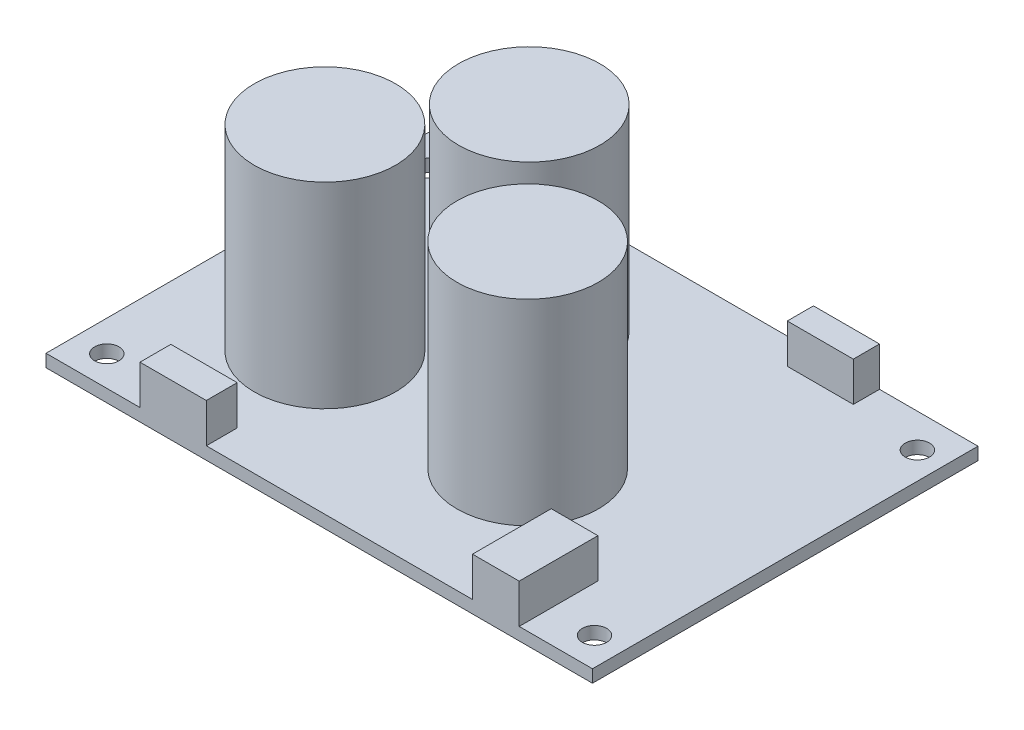
ISO-10303-21;
HEADER;
FILE_DESCRIPTION(('STEP AP214'),'2;1');
FILE_NAME('part.step','',(''),(''),'','','');
FILE_SCHEMA(('AUTOMOTIVE_DESIGN { 1 0 10303 214 1 1 1 1 }'));
ENDSEC;
DATA;
#1=APPLICATION_CONTEXT('core data for automotive mechanical design processes');
#2=APPLICATION_PROTOCOL_DEFINITION('international standard','automotive_design',2000,#1);
#3=PRODUCT_CONTEXT('',#1,'mechanical');
#4=PRODUCT('Part','Part','',(#3));
#5=PRODUCT_RELATED_PRODUCT_CATEGORY('part','',(#4));
#6=PRODUCT_DEFINITION_FORMATION('','',#4);
#7=PRODUCT_DEFINITION_CONTEXT('part definition',#1,'design');
#8=PRODUCT_DEFINITION('design','',#6,#7);
#9=PRODUCT_DEFINITION_SHAPE('','',#8);
#10=(LENGTH_UNIT() NAMED_UNIT(*) SI_UNIT(.MILLI.,.METRE.));
#11=(NAMED_UNIT(*) PLANE_ANGLE_UNIT() SI_UNIT($,.RADIAN.));
#12=(NAMED_UNIT(*) SI_UNIT($,.STERADIAN.) SOLID_ANGLE_UNIT());
#13=UNCERTAINTY_MEASURE_WITH_UNIT(LENGTH_MEASURE(1.E-05),#10,'distance_accuracy_value','');
#14=(GEOMETRIC_REPRESENTATION_CONTEXT(3) GLOBAL_UNCERTAINTY_ASSIGNED_CONTEXT((#13)) GLOBAL_UNIT_ASSIGNED_CONTEXT((#10,
#11,#12)) REPRESENTATION_CONTEXT('',''));
#15=CARTESIAN_POINT('',(0.,0.,0.));
#16=DIRECTION('',(0.,0.,1.));
#17=DIRECTION('',(1.,0.,0.));
#18=AXIS2_PLACEMENT_3D('',#15,#16,#17);
#19=CARTESIAN_POINT('',(0.,1.6,0.));
#20=DIRECTION('',(0.,1.,0.));
#21=DIRECTION('',(0.,0.,1.));
#22=AXIS2_PLACEMENT_3D('',#19,#20,#21);
#23=PLANE('',#22);
#24=CARTESIAN_POINT('',(66.17,1.6,4.29));
#25=DIRECTION('',(0.,1.,0.));
#26=DIRECTION('',(0.,0.,1.));
#27=AXIS2_PLACEMENT_3D('',#24,#25,#26);
#28=CIRCLE('',#27,1.54999999999999);
#29=CARTESIAN_POINT('',(66.17,1.6,5.84));
#30=VERTEX_POINT('',#29);
#31=EDGE_CURVE('E290',#30,#30,#28,.T.);
#32=ORIENTED_EDGE('',*,*,#31,.F.);
#33=EDGE_LOOP('',(#32));
#34=FACE_BOUND('',#33,.T.);
#35=CARTESIAN_POINT('',(66.044,1.6,45.29));
#36=DIRECTION('',(0.,1.,0.));
#37=DIRECTION('',(0.,0.,1.));
#38=AXIS2_PLACEMENT_3D('',#35,#36,#37);
#39=CIRCLE('',#38,1.54999999999999);
#40=CARTESIAN_POINT('',(66.044,1.6,46.84));
#41=VERTEX_POINT('',#40);
#42=EDGE_CURVE('E296',#41,#41,#39,.T.);
#43=ORIENTED_EDGE('',*,*,#42,.F.);
#44=EDGE_LOOP('',(#43));
#45=FACE_BOUND('',#44,.T.);
#46=CARTESIAN_POINT('',(3.937,1.6,45.29));
#47=DIRECTION('',(0.,1.,0.));
#48=DIRECTION('',(0.,0.,1.));
#49=AXIS2_PLACEMENT_3D('',#46,#47,#48);
#50=CIRCLE('',#49,1.55);
#51=CARTESIAN_POINT('',(3.937,1.6,46.84));
#52=VERTEX_POINT('',#51);
#53=EDGE_CURVE('E285',#52,#52,#50,.T.);
#54=ORIENTED_EDGE('',*,*,#53,.F.);
#55=EDGE_LOOP('',(#54));
#56=FACE_BOUND('',#55,.T.);
#57=CARTESIAN_POINT('',(3.937,1.6,4.318));
#58=DIRECTION('',(0.,1.,0.));
#59=DIRECTION('',(0.,0.,1.));
#60=AXIS2_PLACEMENT_3D('',#57,#58,#59);
#61=CIRCLE('',#60,1.55);
#62=CARTESIAN_POINT('',(3.937,1.6,5.868));
#63=VERTEX_POINT('',#62);
#64=EDGE_CURVE('E289',#63,#63,#61,.T.);
#65=ORIENTED_EDGE('',*,*,#64,.F.);
#66=EDGE_LOOP('',(#65));
#67=FACE_BOUND('',#66,.T.);
#68=CARTESIAN_POINT('',(43.3529168564064,1.6,31.1081656053034));
#69=DIRECTION('',(0.,1.,0.));
#70=DIRECTION('',(0.,0.,1.));
#71=AXIS2_PLACEMENT_3D('',#68,#69,#70);
#72=CIRCLE('',#71,9.);
#73=CARTESIAN_POINT('',(43.3529168564064,1.6,40.1081656053034));
#74=VERTEX_POINT('',#73);
#75=EDGE_CURVE('E307',#74,#74,#72,.T.);
#76=ORIENTED_EDGE('',*,*,#75,.F.);
#77=EDGE_LOOP('',(#76));
#78=FACE_BOUND('',#77,.T.);
#79=CARTESIAN_POINT('',(28.3278131283282,1.6,15.8842949446125));
#80=DIRECTION('',(0.,1.,0.));
#81=DIRECTION('',(0.,0.,1.));
#82=AXIS2_PLACEMENT_3D('',#79,#80,#81);
#83=CIRCLE('',#82,9.);
#84=CARTESIAN_POINT('',(28.3278131283282,1.6,24.8842949446125));
#85=VERTEX_POINT('',#84);
#86=EDGE_CURVE('E313',#85,#85,#83,.T.);
#87=ORIENTED_EDGE('',*,*,#86,.F.);
#88=EDGE_LOOP('',(#87));
#89=FACE_BOUND('',#88,.T.);
#90=CARTESIAN_POINT('',(17.5287955914882,1.6,31.1081656053034));
#91=DIRECTION('',(0.,1.,0.));
#92=DIRECTION('',(0.,0.,1.));
#93=AXIS2_PLACEMENT_3D('',#90,#91,#92);
#94=CIRCLE('',#93,9.);
#95=CARTESIAN_POINT('',(17.5287955914882,1.6,40.1081656053034));
#96=VERTEX_POINT('',#95);
#97=EDGE_CURVE('E319',#96,#96,#94,.T.);
#98=ORIENTED_EDGE('',*,*,#97,.F.);
#99=EDGE_LOOP('',(#98));
#100=FACE_BOUND('',#99,.T.);
#101=DIRECTION('',(1.,0.,0.));
#102=VECTOR('',#101,1.);
#103=CARTESIAN_POINT('',(0.,1.6,49.1));
#104=LINE('',#103,#102);
#105=CARTESIAN_POINT('',(20.4169105502388,1.6,49.1));
#106=VERTEX_POINT('',#105);
#107=CARTESIAN_POINT('',(54.3193514600375,1.6,49.1));
#108=VERTEX_POINT('',#107);
#109=EDGE_CURVE('E336',#106,#108,#104,.T.);
#110=ORIENTED_EDGE('',*,*,#109,.T.);
#111=DIRECTION('',(0.,0.,1.));
#112=VECTOR('',#111,1.);
#113=CARTESIAN_POINT('',(54.3193514600375,1.6,49.1));
#114=LINE('',#113,#112);
#115=CARTESIAN_POINT('',(54.3193514600375,1.6,39.0733400681));
#116=VERTEX_POINT('',#115);
#117=EDGE_CURVE('E53',#116,#108,#114,.T.);
#118=ORIENTED_EDGE('',*,*,#117,.F.);
#119=DIRECTION('',(-1.,0.,0.));
#120=VECTOR('',#119,1.);
#121=CARTESIAN_POINT('',(54.3193514600375,1.6,39.0733400681));
#122=LINE('',#121,#120);
#123=CARTESIAN_POINT('',(60.2646110576472,1.6,39.0733400681));
#124=VERTEX_POINT('',#123);
#125=EDGE_CURVE('E48',#124,#116,#122,.T.);
#126=ORIENTED_EDGE('',*,*,#125,.F.);
#127=DIRECTION('',(0.,0.,-1.));
#128=VECTOR('',#127,1.);
#129=CARTESIAN_POINT('',(60.2646110576472,1.6,49.1));
#130=LINE('',#129,#128);
#131=CARTESIAN_POINT('',(60.2646110576472,1.6,49.1));
#132=VERTEX_POINT('',#131);
#133=EDGE_CURVE('E678',#132,#124,#130,.T.);
#134=ORIENTED_EDGE('',*,*,#133,.F.);
#135=CARTESIAN_POINT('',(69.6,1.6,49.1));
#136=VERTEX_POINT('',#135);
#137=EDGE_CURVE('E331',#132,#136,#104,.T.);
#138=ORIENTED_EDGE('',*,*,#137,.T.);
#139=DIRECTION('',(0.,0.,-1.));
#140=VECTOR('',#139,1.);
#141=CARTESIAN_POINT('',(69.6,1.6,0.));
#142=LINE('',#141,#140);
#143=CARTESIAN_POINT('',(69.6,1.6,0.));
#144=VERTEX_POINT('',#143);
#145=EDGE_CURVE('E335',#136,#144,#142,.T.);
#146=ORIENTED_EDGE('',*,*,#145,.T.);
#147=DIRECTION('',(-1.,0.,0.));
#148=VECTOR('',#147,1.);
#149=CARTESIAN_POINT('',(0.,1.6,0.));
#150=LINE('',#149,#148);
#151=CARTESIAN_POINT('',(57.0561586788756,1.6,0.));
#152=VERTEX_POINT('',#151);
#153=EDGE_CURVE('E339',#144,#152,#150,.T.);
#154=ORIENTED_EDGE('',*,*,#153,.T.);
#155=DIRECTION('',(0.,0.,-1.));
#156=VECTOR('',#155,1.);
#157=CARTESIAN_POINT('',(57.0561586788756,1.6,0.));
#158=LINE('',#157,#156);
#159=CARTESIAN_POINT('',(57.0561586788756,1.6,3.33602947353029));
#160=VERTEX_POINT('',#159);
#161=EDGE_CURVE('E230',#160,#152,#158,.T.);
#162=ORIENTED_EDGE('',*,*,#161,.F.);
#163=DIRECTION('',(1.,0.,0.));
#164=VECTOR('',#163,1.);
#165=CARTESIAN_POINT('',(48.6444012366292,1.6,3.33602947353029));
#166=LINE('',#165,#164);
#167=CARTESIAN_POINT('',(48.6444012366292,1.6,3.33602947353029));
#168=VERTEX_POINT('',#167);
#169=EDGE_CURVE('E239',#168,#160,#166,.T.);
#170=ORIENTED_EDGE('',*,*,#169,.F.);
#171=DIRECTION('',(0.,0.,1.));
#172=VECTOR('',#171,1.);
#173=CARTESIAN_POINT('',(48.6444012366292,1.6,0.));
#174=LINE('',#173,#172);
#175=CARTESIAN_POINT('',(48.6444012366292,1.6,0.));
#176=VERTEX_POINT('',#175);
#177=EDGE_CURVE('E225',#176,#168,#174,.T.);
#178=ORIENTED_EDGE('',*,*,#177,.F.);
#179=CARTESIAN_POINT('',(20.913829574198,1.6,0.));
#180=VERTEX_POINT('',#179);
#181=EDGE_CURVE('E342',#176,#180,#150,.T.);
#182=ORIENTED_EDGE('',*,*,#181,.T.);
#183=DIRECTION('',(0.,0.,-1.));
#184=VECTOR('',#183,1.);
#185=CARTESIAN_POINT('',(20.913829574198,1.6,0.));
#186=LINE('',#185,#184);
#187=CARTESIAN_POINT('',(20.913829574198,1.6,3.63480811529371));
#188=VERTEX_POINT('',#187);
#189=EDGE_CURVE('E260',#188,#180,#186,.T.);
#190=ORIENTED_EDGE('',*,*,#189,.F.);
#191=DIRECTION('',(1.,0.,0.));
#192=VECTOR('',#191,1.);
#193=CARTESIAN_POINT('',(13.7785554401688,1.6,3.63480811529371));
#194=LINE('',#193,#192);
#195=CARTESIAN_POINT('',(13.7785554401688,1.6,3.63480811529371));
#196=VERTEX_POINT('',#195);
#197=EDGE_CURVE('E269',#196,#188,#194,.T.);
#198=ORIENTED_EDGE('',*,*,#197,.F.);
#199=DIRECTION('',(0.,0.,1.));
#200=VECTOR('',#199,1.);
#201=CARTESIAN_POINT('',(13.7785554401688,1.6,0.));
#202=LINE('',#201,#200);
#203=CARTESIAN_POINT('',(13.7785554401688,1.6,0.));
#204=VERTEX_POINT('',#203);
#205=EDGE_CURVE('E255',#204,#196,#202,.T.);
#206=ORIENTED_EDGE('',*,*,#205,.F.);
#207=CARTESIAN_POINT('',(0.,1.6,0.));
#208=VERTEX_POINT('',#207);
#209=EDGE_CURVE('E338',#204,#208,#150,.T.);
#210=ORIENTED_EDGE('',*,*,#209,.T.);
#211=DIRECTION('',(0.,0.,1.));
#212=VECTOR('',#211,1.);
#213=CARTESIAN_POINT('',(0.,1.6,0.));
#214=LINE('',#213,#212);
#215=CARTESIAN_POINT('',(0.,1.6,49.1));
#216=VERTEX_POINT('',#215);
#217=EDGE_CURVE('E328',#208,#216,#214,.T.);
#218=ORIENTED_EDGE('',*,*,#217,.T.);
#219=CARTESIAN_POINT('',(11.9680360325845,1.6,49.1));
#220=VERTEX_POINT('',#219);
#221=EDGE_CURVE('E333',#216,#220,#104,.T.);
#222=ORIENTED_EDGE('',*,*,#221,.T.);
#223=DIRECTION('',(0.,0.,1.));
#224=VECTOR('',#223,1.);
#225=CARTESIAN_POINT('',(11.9680360325845,1.6,49.1));
#226=LINE('',#225,#224);
#227=CARTESIAN_POINT('',(11.9680360325845,1.6,45.166072132929));
#228=VERTEX_POINT('',#227);
#229=EDGE_CURVE('E190',#228,#220,#226,.T.);
#230=ORIENTED_EDGE('',*,*,#229,.F.);
#231=DIRECTION('',(-1.,0.,0.));
#232=VECTOR('',#231,1.);
#233=CARTESIAN_POINT('',(11.9680360325845,1.6,45.166072132929));
#234=LINE('',#233,#232);
#235=CARTESIAN_POINT('',(20.4169105502388,1.6,45.166072132929));
#236=VERTEX_POINT('',#235);
#237=EDGE_CURVE('E203',#236,#228,#234,.T.);
#238=ORIENTED_EDGE('',*,*,#237,.F.);
#239=DIRECTION('',(0.,0.,-1.));
#240=VECTOR('',#239,1.);
#241=CARTESIAN_POINT('',(20.4169105502388,1.6,49.1));
#242=LINE('',#241,#240);
#243=EDGE_CURVE('E193',#106,#236,#242,.T.);
#244=ORIENTED_EDGE('',*,*,#243,.F.);
#245=EDGE_LOOP('',(#110,#118,#126,#134,#138,#146,#154,#162,#170,#178,#182,#190,#198,#206,#210,
#218,#222,#230,#238,#244));
#246=FACE_BOUND('',#245,.T.);
#247=ADVANCED_FACE('F33',(#34,#45,#56,#67,#78,#89,#100,#246),#23,.T.);
#248=CARTESIAN_POINT('',(0.,1.6,0.));
#249=DIRECTION('',(1.,0.,0.));
#250=DIRECTION('',(0.,0.,-1.));
#251=AXIS2_PLACEMENT_3D('',#248,#249,#250);
#252=PLANE('',#251);
#253=DIRECTION('',(0.,0.,1.));
#254=VECTOR('',#253,1.);
#255=CARTESIAN_POINT('',(0.,0.,0.));
#256=LINE('',#255,#254);
#257=CARTESIAN_POINT('',(0.,0.,0.));
#258=VERTEX_POINT('',#257);
#259=CARTESIAN_POINT('',(0.,0.,49.1));
#260=VERTEX_POINT('',#259);
#261=EDGE_CURVE('E325',#258,#260,#256,.T.);
#262=ORIENTED_EDGE('',*,*,#261,.T.);
#263=DIRECTION('',(0.,-1.,0.));
#264=VECTOR('',#263,1.);
#265=CARTESIAN_POINT('',(0.,1.6,49.1));
#266=LINE('',#265,#264);
#267=EDGE_CURVE('E11',#216,#260,#266,.T.);
#268=ORIENTED_EDGE('',*,*,#267,.F.);
#269=ORIENTED_EDGE('',*,*,#217,.F.);
#270=DIRECTION('',(0.,-1.,0.));
#271=VECTOR('',#270,1.);
#272=CARTESIAN_POINT('',(0.,1.6,0.));
#273=LINE('',#272,#271);
#274=EDGE_CURVE('E341',#208,#258,#273,.T.);
#275=ORIENTED_EDGE('',*,*,#274,.T.);
#276=EDGE_LOOP('',(#262,#268,#269,#275));
#277=FACE_BOUND('',#276,.T.);
#278=ADVANCED_FACE('F35',(#277),#252,.F.);
#279=CARTESIAN_POINT('',(0.,1.6,49.1));
#280=DIRECTION('',(0.,0.,-1.));
#281=DIRECTION('',(-1.,0.,0.));
#282=AXIS2_PLACEMENT_3D('',#279,#280,#281);
#283=PLANE('',#282);
#284=DIRECTION('',(1.,0.,0.));
#285=VECTOR('',#284,1.);
#286=CARTESIAN_POINT('',(0.,0.,49.1));
#287=LINE('',#286,#285);
#288=CARTESIAN_POINT('',(69.6,0.,49.1));
#289=VERTEX_POINT('',#288);
#290=EDGE_CURVE('E345',#260,#289,#287,.T.);
#291=ORIENTED_EDGE('',*,*,#290,.T.);
#292=DIRECTION('',(0.,-1.,0.));
#293=VECTOR('',#292,1.);
#294=CARTESIAN_POINT('',(69.6,1.6,49.1));
#295=LINE('',#294,#293);
#296=EDGE_CURVE('E41',#136,#289,#295,.T.);
#297=ORIENTED_EDGE('',*,*,#296,.F.);
#298=ORIENTED_EDGE('',*,*,#137,.F.);
#299=DIRECTION('',(0.,-1.,0.));
#300=VECTOR('',#299,1.);
#301=CARTESIAN_POINT('',(60.2646110576472,6.6,49.1));
#302=LINE('',#301,#300);
#303=CARTESIAN_POINT('',(60.2646110576472,6.6,49.1));
#304=VERTEX_POINT('',#303);
#305=EDGE_CURVE('E175',#304,#132,#302,.T.);
#306=ORIENTED_EDGE('',*,*,#305,.F.);
#307=DIRECTION('',(1.,0.,0.));
#308=VECTOR('',#307,1.);
#309=CARTESIAN_POINT('',(54.3193514600375,6.6,49.1));
#310=LINE('',#309,#308);
#311=CARTESIAN_POINT('',(54.3193514600375,6.6,49.1));
#312=VERTEX_POINT('',#311);
#313=EDGE_CURVE('E169',#312,#304,#310,.T.);
#314=ORIENTED_EDGE('',*,*,#313,.F.);
#315=DIRECTION('',(0.,-1.,0.));
#316=VECTOR('',#315,1.);
#317=CARTESIAN_POINT('',(54.3193514600375,6.6,49.1));
#318=LINE('',#317,#316);
#319=EDGE_CURVE('E173',#312,#108,#318,.T.);
#320=ORIENTED_EDGE('',*,*,#319,.T.);
#321=ORIENTED_EDGE('',*,*,#109,.F.);
#322=DIRECTION('',(0.,-1.,0.));
#323=VECTOR('',#322,1.);
#324=CARTESIAN_POINT('',(20.4169105502388,6.6,49.1));
#325=LINE('',#324,#323);
#326=CARTESIAN_POINT('',(20.4169105502388,6.6,49.1));
#327=VERTEX_POINT('',#326);
#328=EDGE_CURVE('E219',#327,#106,#325,.T.);
#329=ORIENTED_EDGE('',*,*,#328,.F.);
#330=DIRECTION('',(1.,0.,0.));
#331=VECTOR('',#330,1.);
#332=CARTESIAN_POINT('',(11.9680360325845,6.6,49.1));
#333=LINE('',#332,#331);
#334=CARTESIAN_POINT('',(11.9680360325845,6.6,49.1));
#335=VERTEX_POINT('',#334);
#336=EDGE_CURVE('E202',#335,#327,#333,.T.);
#337=ORIENTED_EDGE('',*,*,#336,.F.);
#338=DIRECTION('',(0.,-1.,0.));
#339=VECTOR('',#338,1.);
#340=CARTESIAN_POINT('',(11.9680360325845,6.6,49.1));
#341=LINE('',#340,#339);
#342=EDGE_CURVE('E222',#335,#220,#341,.T.);
#343=ORIENTED_EDGE('',*,*,#342,.T.);
#344=ORIENTED_EDGE('',*,*,#221,.F.);
#345=ORIENTED_EDGE('',*,*,#267,.T.);
#346=EDGE_LOOP('',(#291,#297,#298,#306,#314,#320,#321,#329,#337,#343,#344,#345));
#347=FACE_BOUND('',#346,.T.);
#348=ADVANCED_FACE('F171',(#347),#283,.F.);
#349=CARTESIAN_POINT('',(69.6,1.6,0.));
#350=DIRECTION('',(-1.,0.,0.));
#351=DIRECTION('',(0.,0.,1.));
#352=AXIS2_PLACEMENT_3D('',#349,#350,#351);
#353=PLANE('',#352);
#354=DIRECTION('',(0.,0.,-1.));
#355=VECTOR('',#354,1.);
#356=CARTESIAN_POINT('',(69.6,0.,0.));
#357=LINE('',#356,#355);
#358=CARTESIAN_POINT('',(69.6,0.,0.));
#359=VERTEX_POINT('',#358);
#360=EDGE_CURVE('E347',#289,#359,#357,.T.);
#361=ORIENTED_EDGE('',*,*,#360,.T.);
#362=DIRECTION('',(0.,-1.,0.));
#363=VECTOR('',#362,1.);
#364=CARTESIAN_POINT('',(69.6,1.6,0.));
#365=LINE('',#364,#363);
#366=EDGE_CURVE('E352',#144,#359,#365,.T.);
#367=ORIENTED_EDGE('',*,*,#366,.F.);
#368=ORIENTED_EDGE('',*,*,#145,.F.);
#369=ORIENTED_EDGE('',*,*,#296,.T.);
#370=EDGE_LOOP('',(#361,#367,#368,#369));
#371=FACE_BOUND('',#370,.T.);
#372=ADVANCED_FACE('F359',(#371),#353,.F.);
#373=CARTESIAN_POINT('',(0.,1.6,0.));
#374=DIRECTION('',(0.,0.,1.));
#375=DIRECTION('',(1.,0.,0.));
#376=AXIS2_PLACEMENT_3D('',#373,#374,#375);
#377=PLANE('',#376);
#378=DIRECTION('',(-1.,0.,0.));
#379=VECTOR('',#378,1.);
#380=CARTESIAN_POINT('',(0.,0.,0.));
#381=LINE('',#380,#379);
#382=EDGE_CURVE('E332',#359,#258,#381,.T.);
#383=ORIENTED_EDGE('',*,*,#382,.T.);
#384=ORIENTED_EDGE('',*,*,#274,.F.);
#385=ORIENTED_EDGE('',*,*,#209,.F.);
#386=DIRECTION('',(0.,-1.,0.));
#387=VECTOR('',#386,1.);
#388=CARTESIAN_POINT('',(13.7785554401688,6.6,0.));
#389=LINE('',#388,#387);
#390=CARTESIAN_POINT('',(13.7785554401688,6.6,0.));
#391=VERTEX_POINT('',#390);
#392=EDGE_CURVE('E266',#391,#204,#389,.T.);
#393=ORIENTED_EDGE('',*,*,#392,.F.);
#394=DIRECTION('',(-1.,0.,0.));
#395=VECTOR('',#394,1.);
#396=CARTESIAN_POINT('',(13.7785554401688,6.6,0.));
#397=LINE('',#396,#395);
#398=CARTESIAN_POINT('',(20.913829574198,6.6,0.));
#399=VERTEX_POINT('',#398);
#400=EDGE_CURVE('E264',#399,#391,#397,.T.);
#401=ORIENTED_EDGE('',*,*,#400,.F.);
#402=DIRECTION('',(0.,-1.,0.));
#403=VECTOR('',#402,1.);
#404=CARTESIAN_POINT('',(20.913829574198,6.6,0.));
#405=LINE('',#404,#403);
#406=EDGE_CURVE('E276',#399,#180,#405,.T.);
#407=ORIENTED_EDGE('',*,*,#406,.T.);
#408=ORIENTED_EDGE('',*,*,#181,.F.);
#409=DIRECTION('',(0.,-1.,0.));
#410=VECTOR('',#409,1.);
#411=CARTESIAN_POINT('',(48.6444012366292,6.6,0.));
#412=LINE('',#411,#410);
#413=CARTESIAN_POINT('',(48.6444012366292,6.6,0.));
#414=VERTEX_POINT('',#413);
#415=EDGE_CURVE('E236',#414,#176,#412,.T.);
#416=ORIENTED_EDGE('',*,*,#415,.F.);
#417=DIRECTION('',(-1.,0.,0.));
#418=VECTOR('',#417,1.);
#419=CARTESIAN_POINT('',(48.6444012366292,6.6,0.));
#420=LINE('',#419,#418);
#421=CARTESIAN_POINT('',(57.0561586788756,6.6,0.));
#422=VERTEX_POINT('',#421);
#423=EDGE_CURVE('E234',#422,#414,#420,.T.);
#424=ORIENTED_EDGE('',*,*,#423,.F.);
#425=DIRECTION('',(0.,-1.,0.));
#426=VECTOR('',#425,1.);
#427=CARTESIAN_POINT('',(57.0561586788756,6.6,0.));
#428=LINE('',#427,#426);
#429=EDGE_CURVE('E246',#422,#152,#428,.T.);
#430=ORIENTED_EDGE('',*,*,#429,.T.);
#431=ORIENTED_EDGE('',*,*,#153,.F.);
#432=ORIENTED_EDGE('',*,*,#366,.T.);
#433=EDGE_LOOP('',(#383,#384,#385,#393,#401,#407,#408,#416,#424,#430,#431,#432));
#434=FACE_BOUND('',#433,.T.);
#435=ADVANCED_FACE('F367',(#434),#377,.F.);
#436=CARTESIAN_POINT('',(0.,0.,0.));
#437=DIRECTION('',(0.,1.,0.));
#438=DIRECTION('',(0.,0.,1.));
#439=AXIS2_PLACEMENT_3D('',#436,#437,#438);
#440=PLANE('',#439);
#441=CARTESIAN_POINT('',(66.17,0.,4.29));
#442=DIRECTION('',(0.,1.,0.));
#443=DIRECTION('',(0.,0.,1.));
#444=AXIS2_PLACEMENT_3D('',#441,#442,#443);
#445=CIRCLE('',#444,1.54999999999999);
#446=CARTESIAN_POINT('',(66.17,0.,5.84));
#447=VERTEX_POINT('',#446);
#448=EDGE_CURVE('E286',#447,#447,#445,.T.);
#449=ORIENTED_EDGE('',*,*,#448,.T.);
#450=EDGE_LOOP('',(#449));
#451=FACE_BOUND('',#450,.T.);
#452=CARTESIAN_POINT('',(66.044,0.,45.29));
#453=DIRECTION('',(0.,1.,0.));
#454=DIRECTION('',(0.,0.,1.));
#455=AXIS2_PLACEMENT_3D('',#452,#453,#454);
#456=CIRCLE('',#455,1.54999999999999);
#457=CARTESIAN_POINT('',(66.044,0.,46.84));
#458=VERTEX_POINT('',#457);
#459=EDGE_CURVE('E293',#458,#458,#456,.T.);
#460=ORIENTED_EDGE('',*,*,#459,.T.);
#461=EDGE_LOOP('',(#460));
#462=FACE_BOUND('',#461,.T.);
#463=CARTESIAN_POINT('',(3.937,0.,45.29));
#464=DIRECTION('',(0.,1.,0.));
#465=DIRECTION('',(0.,0.,1.));
#466=AXIS2_PLACEMENT_3D('',#463,#464,#465);
#467=CIRCLE('',#466,1.55);
#468=CARTESIAN_POINT('',(3.937,0.,46.84));
#469=VERTEX_POINT('',#468);
#470=EDGE_CURVE('E299',#469,#469,#467,.T.);
#471=ORIENTED_EDGE('',*,*,#470,.T.);
#472=EDGE_LOOP('',(#471));
#473=FACE_BOUND('',#472,.T.);
#474=CARTESIAN_POINT('',(3.937,0.,4.318));
#475=DIRECTION('',(0.,1.,0.));
#476=DIRECTION('',(0.,0.,1.));
#477=AXIS2_PLACEMENT_3D('',#474,#475,#476);
#478=CIRCLE('',#477,1.55);
#479=CARTESIAN_POINT('',(3.937,0.,5.868));
#480=VERTEX_POINT('',#479);
#481=EDGE_CURVE('E304',#480,#480,#478,.T.);
#482=ORIENTED_EDGE('',*,*,#481,.T.);
#483=EDGE_LOOP('',(#482));
#484=FACE_BOUND('',#483,.T.);
#485=ORIENTED_EDGE('',*,*,#261,.F.);
#486=ORIENTED_EDGE('',*,*,#382,.F.);
#487=ORIENTED_EDGE('',*,*,#360,.F.);
#488=ORIENTED_EDGE('',*,*,#290,.F.);
#489=EDGE_LOOP('',(#485,#486,#487,#488));
#490=FACE_BOUND('',#489,.T.);
#491=ADVANCED_FACE('F364',(#451,#462,#473,#484,#490),#440,.F.);
#492=CARTESIAN_POINT('',(17.5287955914882,26.6,31.1081656053034));
#493=DIRECTION('',(0.,-1.,0.));
#494=DIRECTION('',(0.,0.,-1.));
#495=AXIS2_PLACEMENT_3D('',#492,#493,#494);
#496=CYLINDRICAL_SURFACE('',#495,9.);
#497=CARTESIAN_POINT('',(17.5287955914882,26.6,31.1081656053034));
#498=DIRECTION('',(0.,1.,0.));
#499=DIRECTION('',(0.,0.,1.));
#500=AXIS2_PLACEMENT_3D('',#497,#498,#499);
#501=CIRCLE('',#500,9.);
#502=CARTESIAN_POINT('',(17.5287955914882,26.6,40.1081656053034));
#503=VERTEX_POINT('',#502);
#504=EDGE_CURVE('E322',#503,#503,#501,.T.);
#505=ORIENTED_EDGE('',*,*,#504,.F.);
#506=EDGE_LOOP('',(#505));
#507=FACE_BOUND('',#506,.T.);
#508=ORIENTED_EDGE('',*,*,#97,.T.);
#509=EDGE_LOOP('',(#508));
#510=FACE_BOUND('',#509,.T.);
#511=ADVANCED_FACE('F411',(#507,#510),#496,.T.);
#512=CARTESIAN_POINT('',(17.5287955914882,26.6,31.1081656053034));
#513=DIRECTION('',(0.,1.,0.));
#514=DIRECTION('',(0.,0.,1.));
#515=AXIS2_PLACEMENT_3D('',#512,#513,#514);
#516=PLANE('',#515);
#517=ORIENTED_EDGE('',*,*,#504,.T.);
#518=EDGE_LOOP('',(#517));
#519=FACE_BOUND('',#518,.T.);
#520=ADVANCED_FACE('F444',(#519),#516,.T.);
#521=CARTESIAN_POINT('',(28.3278131283282,26.6,15.8842949446125));
#522=DIRECTION('',(0.,-1.,0.));
#523=DIRECTION('',(0.,0.,-1.));
#524=AXIS2_PLACEMENT_3D('',#521,#522,#523);
#525=CYLINDRICAL_SURFACE('',#524,9.);
#526=CARTESIAN_POINT('',(28.3278131283282,26.6,15.8842949446125));
#527=DIRECTION('',(0.,1.,0.));
#528=DIRECTION('',(0.,0.,1.));
#529=AXIS2_PLACEMENT_3D('',#526,#527,#528);
#530=CIRCLE('',#529,9.);
#531=CARTESIAN_POINT('',(28.3278131283282,26.6,24.8842949446125));
#532=VERTEX_POINT('',#531);
#533=EDGE_CURVE('E316',#532,#532,#530,.T.);
#534=ORIENTED_EDGE('',*,*,#533,.F.);
#535=EDGE_LOOP('',(#534));
#536=FACE_BOUND('',#535,.T.);
#537=ORIENTED_EDGE('',*,*,#86,.T.);
#538=EDGE_LOOP('',(#537));
#539=FACE_BOUND('',#538,.T.);
#540=ADVANCED_FACE('F451',(#536,#539),#525,.T.);
#541=CARTESIAN_POINT('',(28.3278131283282,26.6,15.8842949446125));
#542=DIRECTION('',(0.,1.,0.));
#543=DIRECTION('',(0.,0.,1.));
#544=AXIS2_PLACEMENT_3D('',#541,#542,#543);
#545=PLANE('',#544);
#546=ORIENTED_EDGE('',*,*,#533,.T.);
#547=EDGE_LOOP('',(#546));
#548=FACE_BOUND('',#547,.T.);
#549=ADVANCED_FACE('F458',(#548),#545,.T.);
#550=CARTESIAN_POINT('',(43.3529168564064,26.6,31.1081656053034));
#551=DIRECTION('',(0.,-1.,0.));
#552=DIRECTION('',(0.,0.,-1.));
#553=AXIS2_PLACEMENT_3D('',#550,#551,#552);
#554=CYLINDRICAL_SURFACE('',#553,9.);
#555=CARTESIAN_POINT('',(43.3529168564064,26.6,31.1081656053034));
#556=DIRECTION('',(0.,1.,0.));
#557=DIRECTION('',(0.,0.,1.));
#558=AXIS2_PLACEMENT_3D('',#555,#556,#557);
#559=CIRCLE('',#558,9.);
#560=CARTESIAN_POINT('',(43.3529168564064,26.6,40.1081656053034));
#561=VERTEX_POINT('',#560);
#562=EDGE_CURVE('E310',#561,#561,#559,.T.);
#563=ORIENTED_EDGE('',*,*,#562,.F.);
#564=EDGE_LOOP('',(#563));
#565=FACE_BOUND('',#564,.T.);
#566=ORIENTED_EDGE('',*,*,#75,.T.);
#567=EDGE_LOOP('',(#566));
#568=FACE_BOUND('',#567,.T.);
#569=ADVANCED_FACE('F466',(#565,#568),#554,.T.);
#570=CARTESIAN_POINT('',(43.3529168564064,26.6,31.1081656053034));
#571=DIRECTION('',(0.,1.,0.));
#572=DIRECTION('',(0.,0.,1.));
#573=AXIS2_PLACEMENT_3D('',#570,#571,#572);
#574=PLANE('',#573);
#575=ORIENTED_EDGE('',*,*,#562,.T.);
#576=EDGE_LOOP('',(#575));
#577=FACE_BOUND('',#576,.T.);
#578=ADVANCED_FACE('F474',(#577),#574,.T.);
#579=CARTESIAN_POINT('',(3.937,0.,4.318));
#580=DIRECTION('',(0.,1.,0.));
#581=DIRECTION('',(0.,0.,1.));
#582=AXIS2_PLACEMENT_3D('',#579,#580,#581);
#583=CYLINDRICAL_SURFACE('',#582,1.55);
#584=ORIENTED_EDGE('',*,*,#481,.F.);
#585=EDGE_LOOP('',(#584));
#586=FACE_BOUND('',#585,.T.);
#587=ORIENTED_EDGE('',*,*,#64,.T.);
#588=EDGE_LOOP('',(#587));
#589=FACE_BOUND('',#588,.T.);
#590=ADVANCED_FACE('F481',(#586,#589),#583,.F.);
#591=CARTESIAN_POINT('',(3.937,0.,45.29));
#592=DIRECTION('',(0.,1.,0.));
#593=DIRECTION('',(0.,0.,1.));
#594=AXIS2_PLACEMENT_3D('',#591,#592,#593);
#595=CYLINDRICAL_SURFACE('',#594,1.55);
#596=ORIENTED_EDGE('',*,*,#470,.F.);
#597=EDGE_LOOP('',(#596));
#598=FACE_BOUND('',#597,.T.);
#599=ORIENTED_EDGE('',*,*,#53,.T.);
#600=EDGE_LOOP('',(#599));
#601=FACE_BOUND('',#600,.T.);
#602=ADVANCED_FACE('F488',(#598,#601),#595,.F.);
#603=CARTESIAN_POINT('',(66.044,0.,45.29));
#604=DIRECTION('',(0.,1.,0.));
#605=DIRECTION('',(0.,0.,1.));
#606=AXIS2_PLACEMENT_3D('',#603,#604,#605);
#607=CYLINDRICAL_SURFACE('',#606,1.54999999999999);
#608=ORIENTED_EDGE('',*,*,#459,.F.);
#609=EDGE_LOOP('',(#608));
#610=FACE_BOUND('',#609,.T.);
#611=ORIENTED_EDGE('',*,*,#42,.T.);
#612=EDGE_LOOP('',(#611));
#613=FACE_BOUND('',#612,.T.);
#614=ADVANCED_FACE('F398',(#610,#613),#607,.F.);
#615=CARTESIAN_POINT('',(66.17,0.,4.29));
#616=DIRECTION('',(0.,1.,0.));
#617=DIRECTION('',(0.,0.,1.));
#618=AXIS2_PLACEMENT_3D('',#615,#616,#617);
#619=CYLINDRICAL_SURFACE('',#618,1.54999999999999);
#620=ORIENTED_EDGE('',*,*,#448,.F.);
#621=EDGE_LOOP('',(#620));
#622=FACE_BOUND('',#621,.T.);
#623=ORIENTED_EDGE('',*,*,#31,.T.);
#624=EDGE_LOOP('',(#623));
#625=FACE_BOUND('',#624,.T.);
#626=ADVANCED_FACE('F391',(#622,#625),#619,.F.);
#627=CARTESIAN_POINT('',(13.7785554401688,6.6,0.));
#628=DIRECTION('',(1.,0.,0.));
#629=DIRECTION('',(0.,0.,-1.));
#630=AXIS2_PLACEMENT_3D('',#627,#628,#629);
#631=PLANE('',#630);
#632=ORIENTED_EDGE('',*,*,#205,.T.);
#633=DIRECTION('',(0.,-1.,0.));
#634=VECTOR('',#633,1.);
#635=CARTESIAN_POINT('',(13.7785554401688,6.6,3.63480811529371));
#636=LINE('',#635,#634);
#637=CARTESIAN_POINT('',(13.7785554401688,6.6,3.63480811529371));
#638=VERTEX_POINT('',#637);
#639=EDGE_CURVE('E282',#638,#196,#636,.T.);
#640=ORIENTED_EDGE('',*,*,#639,.F.);
#641=DIRECTION('',(0.,0.,1.));
#642=VECTOR('',#641,1.);
#643=CARTESIAN_POINT('',(13.7785554401688,6.6,0.));
#644=LINE('',#643,#642);
#645=EDGE_CURVE('E256',#391,#638,#644,.T.);
#646=ORIENTED_EDGE('',*,*,#645,.F.);
#647=ORIENTED_EDGE('',*,*,#392,.T.);
#648=EDGE_LOOP('',(#632,#640,#646,#647));
#649=FACE_BOUND('',#648,.T.);
#650=ADVANCED_FACE('F389',(#649),#631,.F.);
#651=CARTESIAN_POINT('',(13.7785554401688,6.6,3.63480811529371));
#652=DIRECTION('',(0.,0.,-1.));
#653=DIRECTION('',(-1.,0.,0.));
#654=AXIS2_PLACEMENT_3D('',#651,#652,#653);
#655=PLANE('',#654);
#656=ORIENTED_EDGE('',*,*,#197,.T.);
#657=DIRECTION('',(0.,-1.,0.));
#658=VECTOR('',#657,1.);
#659=CARTESIAN_POINT('',(20.913829574198,6.6,3.63480811529371));
#660=LINE('',#659,#658);
#661=CARTESIAN_POINT('',(20.913829574198,6.6,3.63480811529371));
#662=VERTEX_POINT('',#661);
#663=EDGE_CURVE('E279',#662,#188,#660,.T.);
#664=ORIENTED_EDGE('',*,*,#663,.F.);
#665=DIRECTION('',(1.,0.,0.));
#666=VECTOR('',#665,1.);
#667=CARTESIAN_POINT('',(13.7785554401688,6.6,3.63480811529371));
#668=LINE('',#667,#666);
#669=EDGE_CURVE('E259',#638,#662,#668,.T.);
#670=ORIENTED_EDGE('',*,*,#669,.F.);
#671=ORIENTED_EDGE('',*,*,#639,.T.);
#672=EDGE_LOOP('',(#656,#664,#670,#671));
#673=FACE_BOUND('',#672,.T.);
#674=ADVANCED_FACE('F387',(#673),#655,.F.);
#675=CARTESIAN_POINT('',(20.913829574198,6.6,0.));
#676=DIRECTION('',(-1.,0.,0.));
#677=DIRECTION('',(0.,0.,1.));
#678=AXIS2_PLACEMENT_3D('',#675,#676,#677);
#679=PLANE('',#678);
#680=ORIENTED_EDGE('',*,*,#189,.T.);
#681=ORIENTED_EDGE('',*,*,#406,.F.);
#682=DIRECTION('',(0.,0.,-1.));
#683=VECTOR('',#682,1.);
#684=CARTESIAN_POINT('',(20.913829574198,6.6,0.));
#685=LINE('',#684,#683);
#686=EDGE_CURVE('E262',#662,#399,#685,.T.);
#687=ORIENTED_EDGE('',*,*,#686,.F.);
#688=ORIENTED_EDGE('',*,*,#663,.T.);
#689=EDGE_LOOP('',(#680,#681,#687,#688));
#690=FACE_BOUND('',#689,.T.);
#691=ADVANCED_FACE('F378',(#690),#679,.F.);
#692=CARTESIAN_POINT('',(0.,6.6,0.));
#693=DIRECTION('',(0.,1.,0.));
#694=DIRECTION('',(0.,0.,1.));
#695=AXIS2_PLACEMENT_3D('',#692,#693,#694);
#696=PLANE('',#695);
#697=ORIENTED_EDGE('',*,*,#645,.T.);
#698=ORIENTED_EDGE('',*,*,#669,.T.);
#699=ORIENTED_EDGE('',*,*,#686,.T.);
#700=ORIENTED_EDGE('',*,*,#400,.T.);
#701=EDGE_LOOP('',(#697,#698,#699,#700));
#702=FACE_BOUND('',#701,.T.);
#703=ADVANCED_FACE('F384',(#702),#696,.T.);
#704=CARTESIAN_POINT('',(48.6444012366292,6.6,0.));
#705=DIRECTION('',(1.,0.,0.));
#706=DIRECTION('',(0.,0.,-1.));
#707=AXIS2_PLACEMENT_3D('',#704,#705,#706);
#708=PLANE('',#707);
#709=ORIENTED_EDGE('',*,*,#177,.T.);
#710=DIRECTION('',(0.,-1.,0.));
#711=VECTOR('',#710,1.);
#712=CARTESIAN_POINT('',(48.6444012366292,6.6,3.33602947353029));
#713=LINE('',#712,#711);
#714=CARTESIAN_POINT('',(48.6444012366292,6.6,3.33602947353029));
#715=VERTEX_POINT('',#714);
#716=EDGE_CURVE('E252',#715,#168,#713,.T.);
#717=ORIENTED_EDGE('',*,*,#716,.F.);
#718=DIRECTION('',(0.,0.,1.));
#719=VECTOR('',#718,1.);
#720=CARTESIAN_POINT('',(48.6444012366292,6.6,0.));
#721=LINE('',#720,#719);
#722=EDGE_CURVE('E226',#414,#715,#721,.T.);
#723=ORIENTED_EDGE('',*,*,#722,.F.);
#724=ORIENTED_EDGE('',*,*,#415,.T.);
#725=EDGE_LOOP('',(#709,#717,#723,#724));
#726=FACE_BOUND('',#725,.T.);
#727=ADVANCED_FACE('F555',(#726),#708,.F.);
#728=CARTESIAN_POINT('',(48.6444012366292,6.6,3.33602947353029));
#729=DIRECTION('',(0.,0.,-1.));
#730=DIRECTION('',(-1.,0.,0.));
#731=AXIS2_PLACEMENT_3D('',#728,#729,#730);
#732=PLANE('',#731);
#733=ORIENTED_EDGE('',*,*,#169,.T.);
#734=DIRECTION('',(0.,-1.,0.));
#735=VECTOR('',#734,1.);
#736=CARTESIAN_POINT('',(57.0561586788756,6.6,3.33602947353029));
#737=LINE('',#736,#735);
#738=CARTESIAN_POINT('',(57.0561586788756,6.6,3.33602947353029));
#739=VERTEX_POINT('',#738);
#740=EDGE_CURVE('E249',#739,#160,#737,.T.);
#741=ORIENTED_EDGE('',*,*,#740,.F.);
#742=DIRECTION('',(1.,0.,0.));
#743=VECTOR('',#742,1.);
#744=CARTESIAN_POINT('',(48.6444012366292,6.6,3.33602947353029));
#745=LINE('',#744,#743);
#746=EDGE_CURVE('E229',#715,#739,#745,.T.);
#747=ORIENTED_EDGE('',*,*,#746,.F.);
#748=ORIENTED_EDGE('',*,*,#716,.T.);
#749=EDGE_LOOP('',(#733,#741,#747,#748));
#750=FACE_BOUND('',#749,.T.);
#751=ADVANCED_FACE('F563',(#750),#732,.F.);
#752=CARTESIAN_POINT('',(57.0561586788756,6.6,0.));
#753=DIRECTION('',(-1.,0.,0.));
#754=DIRECTION('',(0.,0.,1.));
#755=AXIS2_PLACEMENT_3D('',#752,#753,#754);
#756=PLANE('',#755);
#757=ORIENTED_EDGE('',*,*,#161,.T.);
#758=ORIENTED_EDGE('',*,*,#429,.F.);
#759=DIRECTION('',(0.,0.,-1.));
#760=VECTOR('',#759,1.);
#761=CARTESIAN_POINT('',(57.0561586788756,6.6,0.));
#762=LINE('',#761,#760);
#763=EDGE_CURVE('E232',#739,#422,#762,.T.);
#764=ORIENTED_EDGE('',*,*,#763,.F.);
#765=ORIENTED_EDGE('',*,*,#740,.T.);
#766=EDGE_LOOP('',(#757,#758,#764,#765));
#767=FACE_BOUND('',#766,.T.);
#768=ADVANCED_FACE('F572',(#767),#756,.F.);
#769=CARTESIAN_POINT('',(0.,6.6,0.));
#770=DIRECTION('',(0.,1.,0.));
#771=DIRECTION('',(0.,0.,1.));
#772=AXIS2_PLACEMENT_3D('',#769,#770,#771);
#773=PLANE('',#772);
#774=ORIENTED_EDGE('',*,*,#722,.T.);
#775=ORIENTED_EDGE('',*,*,#746,.T.);
#776=ORIENTED_EDGE('',*,*,#763,.T.);
#777=ORIENTED_EDGE('',*,*,#423,.T.);
#778=EDGE_LOOP('',(#774,#775,#776,#777));
#779=FACE_BOUND('',#778,.T.);
#780=ADVANCED_FACE('F581',(#779),#773,.T.);
#781=CARTESIAN_POINT('',(11.9680360325845,6.6,49.1));
#782=DIRECTION('',(1.,0.,0.));
#783=DIRECTION('',(0.,0.,-1.));
#784=AXIS2_PLACEMENT_3D('',#781,#782,#783);
#785=PLANE('',#784);
#786=ORIENTED_EDGE('',*,*,#229,.T.);
#787=ORIENTED_EDGE('',*,*,#342,.F.);
#788=DIRECTION('',(0.,0.,1.));
#789=VECTOR('',#788,1.);
#790=CARTESIAN_POINT('',(11.9680360325845,6.6,49.1));
#791=LINE('',#790,#789);
#792=CARTESIAN_POINT('',(11.9680360325845,6.6,45.166072132929));
#793=VERTEX_POINT('',#792);
#794=EDGE_CURVE('E199',#793,#335,#791,.T.);
#795=ORIENTED_EDGE('',*,*,#794,.F.);
#796=DIRECTION('',(0.,-1.,0.));
#797=VECTOR('',#796,1.);
#798=CARTESIAN_POINT('',(11.9680360325845,6.6,45.166072132929));
#799=LINE('',#798,#797);
#800=EDGE_CURVE('E208',#793,#228,#799,.T.);
#801=ORIENTED_EDGE('',*,*,#800,.T.);
#802=EDGE_LOOP('',(#786,#787,#795,#801));
#803=FACE_BOUND('',#802,.T.);
#804=ADVANCED_FACE('F590',(#803),#785,.F.);
#805=CARTESIAN_POINT('',(20.4169105502388,6.6,49.1));
#806=DIRECTION('',(-1.,0.,0.));
#807=DIRECTION('',(0.,0.,1.));
#808=AXIS2_PLACEMENT_3D('',#805,#806,#807);
#809=PLANE('',#808);
#810=ORIENTED_EDGE('',*,*,#243,.T.);
#811=DIRECTION('',(0.,-1.,0.));
#812=VECTOR('',#811,1.);
#813=CARTESIAN_POINT('',(20.4169105502388,6.6,45.166072132929));
#814=LINE('',#813,#812);
#815=CARTESIAN_POINT('',(20.4169105502388,6.6,45.166072132929));
#816=VERTEX_POINT('',#815);
#817=EDGE_CURVE('E216',#816,#236,#814,.T.);
#818=ORIENTED_EDGE('',*,*,#817,.F.);
#819=DIRECTION('',(0.,0.,-1.));
#820=VECTOR('',#819,1.);
#821=CARTESIAN_POINT('',(20.4169105502388,6.6,49.1));
#822=LINE('',#821,#820);
#823=EDGE_CURVE('E205',#327,#816,#822,.T.);
#824=ORIENTED_EDGE('',*,*,#823,.F.);
#825=ORIENTED_EDGE('',*,*,#328,.T.);
#826=EDGE_LOOP('',(#810,#818,#824,#825));
#827=FACE_BOUND('',#826,.T.);
#828=ADVANCED_FACE('F599',(#827),#809,.F.);
#829=CARTESIAN_POINT('',(11.9680360325845,6.6,45.166072132929));
#830=DIRECTION('',(0.,0.,1.));
#831=DIRECTION('',(1.,0.,0.));
#832=AXIS2_PLACEMENT_3D('',#829,#830,#831);
#833=PLANE('',#832);
#834=ORIENTED_EDGE('',*,*,#237,.T.);
#835=ORIENTED_EDGE('',*,*,#800,.F.);
#836=DIRECTION('',(-1.,0.,0.));
#837=VECTOR('',#836,1.);
#838=CARTESIAN_POINT('',(11.9680360325845,6.6,45.166072132929));
#839=LINE('',#838,#837);
#840=EDGE_CURVE('E207',#816,#793,#839,.T.);
#841=ORIENTED_EDGE('',*,*,#840,.F.);
#842=ORIENTED_EDGE('',*,*,#817,.T.);
#843=EDGE_LOOP('',(#834,#835,#841,#842));
#844=FACE_BOUND('',#843,.T.);
#845=ADVANCED_FACE('F608',(#844),#833,.F.);
#846=CARTESIAN_POINT('',(0.,6.6,0.));
#847=DIRECTION('',(0.,-1.,0.));
#848=DIRECTION('',(0.,0.,-1.));
#849=AXIS2_PLACEMENT_3D('',#846,#847,#848);
#850=PLANE('',#849);
#851=ORIENTED_EDGE('',*,*,#794,.T.);
#852=ORIENTED_EDGE('',*,*,#336,.T.);
#853=ORIENTED_EDGE('',*,*,#823,.T.);
#854=ORIENTED_EDGE('',*,*,#840,.T.);
#855=EDGE_LOOP('',(#851,#852,#853,#854));
#856=FACE_BOUND('',#855,.T.);
#857=ADVANCED_FACE('F617',(#856),#850,.F.);
#858=CARTESIAN_POINT('',(54.3193514600375,6.6,49.1));
#859=DIRECTION('',(1.,0.,0.));
#860=DIRECTION('',(0.,0.,-1.));
#861=AXIS2_PLACEMENT_3D('',#858,#859,#860);
#862=PLANE('',#861);
#863=ORIENTED_EDGE('',*,*,#117,.T.);
#864=ORIENTED_EDGE('',*,*,#319,.F.);
#865=DIRECTION('',(0.,0.,1.));
#866=VECTOR('',#865,1.);
#867=CARTESIAN_POINT('',(54.3193514600375,6.6,49.1));
#868=LINE('',#867,#866);
#869=CARTESIAN_POINT('',(54.3193514600375,6.6,39.0733400681));
#870=VERTEX_POINT('',#869);
#871=EDGE_CURVE('E179',#870,#312,#868,.T.);
#872=ORIENTED_EDGE('',*,*,#871,.F.);
#873=DIRECTION('',(0.,-1.,0.));
#874=VECTOR('',#873,1.);
#875=CARTESIAN_POINT('',(54.3193514600375,6.6,39.0733400681));
#876=LINE('',#875,#874);
#877=EDGE_CURVE('E676',#870,#116,#876,.T.);
#878=ORIENTED_EDGE('',*,*,#877,.T.);
#879=EDGE_LOOP('',(#863,#864,#872,#878));
#880=FACE_BOUND('',#879,.T.);
#881=ADVANCED_FACE('F189',(#880),#862,.F.);
#882=CARTESIAN_POINT('',(60.2646110576472,6.6,49.1));
#883=DIRECTION('',(-1.,0.,0.));
#884=DIRECTION('',(0.,0.,1.));
#885=AXIS2_PLACEMENT_3D('',#882,#883,#884);
#886=PLANE('',#885);
#887=ORIENTED_EDGE('',*,*,#133,.T.);
#888=DIRECTION('',(0.,-1.,0.));
#889=VECTOR('',#888,1.);
#890=CARTESIAN_POINT('',(60.2646110576472,6.6,39.0733400681));
#891=LINE('',#890,#889);
#892=CARTESIAN_POINT('',(60.2646110576472,6.6,39.0733400681));
#893=VERTEX_POINT('',#892);
#894=EDGE_CURVE('E195',#893,#124,#891,.T.);
#895=ORIENTED_EDGE('',*,*,#894,.F.);
#896=DIRECTION('',(0.,0.,-1.));
#897=VECTOR('',#896,1.);
#898=CARTESIAN_POINT('',(60.2646110576472,6.6,49.1));
#899=LINE('',#898,#897);
#900=EDGE_CURVE('E178',#304,#893,#899,.T.);
#901=ORIENTED_EDGE('',*,*,#900,.F.);
#902=ORIENTED_EDGE('',*,*,#305,.T.);
#903=EDGE_LOOP('',(#887,#895,#901,#902));
#904=FACE_BOUND('',#903,.T.);
#905=ADVANCED_FACE('F634',(#904),#886,.F.);
#906=CARTESIAN_POINT('',(54.3193514600375,6.6,39.0733400681));
#907=DIRECTION('',(0.,0.,1.));
#908=DIRECTION('',(1.,0.,0.));
#909=AXIS2_PLACEMENT_3D('',#906,#907,#908);
#910=PLANE('',#909);
#911=ORIENTED_EDGE('',*,*,#125,.T.);
#912=ORIENTED_EDGE('',*,*,#877,.F.);
#913=DIRECTION('',(-1.,0.,0.));
#914=VECTOR('',#913,1.);
#915=CARTESIAN_POINT('',(54.3193514600375,6.6,39.0733400681));
#916=LINE('',#915,#914);
#917=EDGE_CURVE('E184',#893,#870,#916,.T.);
#918=ORIENTED_EDGE('',*,*,#917,.F.);
#919=ORIENTED_EDGE('',*,*,#894,.T.);
#920=EDGE_LOOP('',(#911,#912,#918,#919));
#921=FACE_BOUND('',#920,.T.);
#922=ADVANCED_FACE('F642',(#921),#910,.F.);
#923=CARTESIAN_POINT('',(0.,6.6,0.));
#924=DIRECTION('',(0.,-1.,0.));
#925=DIRECTION('',(0.,0.,-1.));
#926=AXIS2_PLACEMENT_3D('',#923,#924,#925);
#927=PLANE('',#926);
#928=ORIENTED_EDGE('',*,*,#871,.T.);
#929=ORIENTED_EDGE('',*,*,#313,.T.);
#930=ORIENTED_EDGE('',*,*,#900,.T.);
#931=ORIENTED_EDGE('',*,*,#917,.T.);
#932=EDGE_LOOP('',(#928,#929,#930,#931));
#933=FACE_BOUND('',#932,.T.);
#934=ADVANCED_FACE('F182',(#933),#927,.F.);
#935=CLOSED_SHELL('',(#247,#278,#348,#372,#435,#491,#511,#520,#540,#549,#569,#578,#590,#602,
#614,#626,#650,#674,#691,#703,#727,#751,#768,#780,#804,#828,#845,#857,#881,#905,#922,#934));
#936=MANIFOLD_SOLID_BREP('B2',#935);
#937=ADVANCED_BREP_SHAPE_REPRESENTATION('',(#18,#936),#14);
#938=SHAPE_DEFINITION_REPRESENTATION(#9,#937);
ENDSEC;
END-ISO-10303-21;
